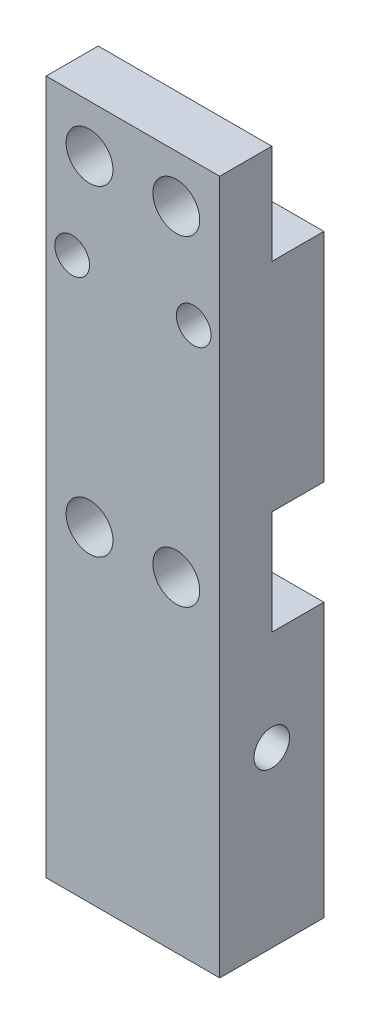
ISO-10303-21;
HEADER;
FILE_DESCRIPTION(('STEP AP214'),'2;1');
FILE_NAME('part.step','',(''),(''),'','','');
FILE_SCHEMA(('AUTOMOTIVE_DESIGN { 1 0 10303 214 1 1 1 1 }'));
ENDSEC;
DATA;
#1=APPLICATION_CONTEXT('core data for automotive mechanical design processes');
#2=APPLICATION_PROTOCOL_DEFINITION('international standard','automotive_design',2000,#1);
#3=PRODUCT_CONTEXT('',#1,'mechanical');
#4=PRODUCT('Part','Part','',(#3));
#5=PRODUCT_RELATED_PRODUCT_CATEGORY('part','',(#4));
#6=PRODUCT_DEFINITION_FORMATION('','',#4);
#7=PRODUCT_DEFINITION_CONTEXT('part definition',#1,'design');
#8=PRODUCT_DEFINITION('design','',#6,#7);
#9=PRODUCT_DEFINITION_SHAPE('','',#8);
#10=(LENGTH_UNIT() NAMED_UNIT(*) SI_UNIT(.MILLI.,.METRE.));
#11=(NAMED_UNIT(*) PLANE_ANGLE_UNIT() SI_UNIT($,.RADIAN.));
#12=(NAMED_UNIT(*) SI_UNIT($,.STERADIAN.) SOLID_ANGLE_UNIT());
#13=UNCERTAINTY_MEASURE_WITH_UNIT(LENGTH_MEASURE(1.E-05),#10,'distance_accuracy_value','');
#14=(GEOMETRIC_REPRESENTATION_CONTEXT(3) GLOBAL_UNCERTAINTY_ASSIGNED_CONTEXT((#13)) GLOBAL_UNIT_ASSIGNED_CONTEXT((#10,
#11,#12)) REPRESENTATION_CONTEXT('',''));
#15=CARTESIAN_POINT('',(0.,0.,0.));
#16=DIRECTION('',(0.,0.,1.));
#17=DIRECTION('',(1.,0.,0.));
#18=AXIS2_PLACEMENT_3D('',#15,#16,#17);
#19=CARTESIAN_POINT('',(0.,40.,0.));
#20=DIRECTION('',(0.,1.,0.));
#21=DIRECTION('',(0.,0.,1.));
#22=AXIS2_PLACEMENT_3D('',#19,#20,#21);
#23=PLANE('',#22);
#24=DIRECTION('',(0.,0.,-1.));
#25=VECTOR('',#24,1.);
#26=CARTESIAN_POINT('',(5.,40.,-3.));
#27=LINE('',#26,#25);
#28=CARTESIAN_POINT('',(5.,40.,3.));
#29=VERTEX_POINT('',#28);
#30=CARTESIAN_POINT('',(5.,40.,0.));
#31=VERTEX_POINT('',#30);
#32=EDGE_CURVE('E240',#29,#31,#27,.T.);
#33=ORIENTED_EDGE('',*,*,#32,.T.);
#34=DIRECTION('',(1.,0.,0.));
#35=VECTOR('',#34,1.);
#36=CARTESIAN_POINT('',(5.,40.,0.));
#37=LINE('',#36,#35);
#38=CARTESIAN_POINT('',(-5.,40.,0.));
#39=VERTEX_POINT('',#38);
#40=EDGE_CURVE('E141',#39,#31,#37,.T.);
#41=ORIENTED_EDGE('',*,*,#40,.F.);
#42=DIRECTION('',(0.,0.,1.));
#43=VECTOR('',#42,1.);
#44=CARTESIAN_POINT('',(-5.,40.,-3.));
#45=LINE('',#44,#43);
#46=CARTESIAN_POINT('',(-5.,40.,3.));
#47=VERTEX_POINT('',#46);
#48=EDGE_CURVE('E235',#39,#47,#45,.T.);
#49=ORIENTED_EDGE('',*,*,#48,.T.);
#50=DIRECTION('',(1.,0.,0.));
#51=VECTOR('',#50,1.);
#52=CARTESIAN_POINT('',(-5.,40.,3.));
#53=LINE('',#52,#51);
#54=EDGE_CURVE('E237',#47,#29,#53,.T.);
#55=ORIENTED_EDGE('',*,*,#54,.T.);
#56=EDGE_LOOP('',(#33,#41,#49,#55));
#57=FACE_BOUND('',#56,.T.);
#58=ADVANCED_FACE('F37',(#57),#23,.T.);
#59=CARTESIAN_POINT('',(-2.5,37.25,-3.));
#60=DIRECTION('',(0.,0.,-1.));
#61=DIRECTION('',(-1.,0.,0.));
#62=AXIS2_PLACEMENT_3D('',#59,#60,#61);
#63=CYLINDRICAL_SURFACE('',#62,1.34999999999999);
#64=CARTESIAN_POINT('',(-2.5,37.25,3.));
#65=DIRECTION('',(0.,0.,-1.));
#66=DIRECTION('',(-1.,0.,0.));
#67=AXIS2_PLACEMENT_3D('',#64,#65,#66);
#68=CIRCLE('',#67,1.35);
#69=CARTESIAN_POINT('',(-3.85,37.25,3.));
#70=VERTEX_POINT('',#69);
#71=EDGE_CURVE('E219',#70,#70,#68,.T.);
#72=ORIENTED_EDGE('',*,*,#71,.F.);
#73=EDGE_LOOP('',(#72));
#74=FACE_BOUND('',#73,.T.);
#75=CARTESIAN_POINT('',(-2.5,37.25,0.));
#76=DIRECTION('',(0.,0.,-1.));
#77=DIRECTION('',(-1.,0.,0.));
#78=AXIS2_PLACEMENT_3D('',#75,#76,#77);
#79=CIRCLE('',#78,1.34999999999999);
#80=CARTESIAN_POINT('',(-3.84999999999999,37.25,0.));
#81=VERTEX_POINT('',#80);
#82=EDGE_CURVE('E156',#81,#81,#79,.F.);
#83=ORIENTED_EDGE('',*,*,#82,.F.);
#84=EDGE_LOOP('',(#83));
#85=FACE_BOUND('',#84,.T.);
#86=ADVANCED_FACE('F281',(#74,#85),#63,.F.);
#87=CARTESIAN_POINT('',(2.5,37.25,-3.));
#88=DIRECTION('',(0.,0.,-1.));
#89=DIRECTION('',(-1.,0.,0.));
#90=AXIS2_PLACEMENT_3D('',#87,#88,#89);
#91=CYLINDRICAL_SURFACE('',#90,1.34999999999999);
#92=CARTESIAN_POINT('',(2.5,37.25,3.));
#93=DIRECTION('',(0.,0.,-1.));
#94=DIRECTION('',(-1.,0.,0.));
#95=AXIS2_PLACEMENT_3D('',#92,#93,#94);
#96=CIRCLE('',#95,1.35);
#97=CARTESIAN_POINT('',(1.15,37.25,3.));
#98=VERTEX_POINT('',#97);
#99=EDGE_CURVE('E216',#98,#98,#96,.T.);
#100=ORIENTED_EDGE('',*,*,#99,.F.);
#101=EDGE_LOOP('',(#100));
#102=FACE_BOUND('',#101,.T.);
#103=CARTESIAN_POINT('',(2.5,37.25,0.));
#104=DIRECTION('',(0.,0.,-1.));
#105=DIRECTION('',(-1.,0.,0.));
#106=AXIS2_PLACEMENT_3D('',#103,#104,#105);
#107=CIRCLE('',#106,1.34999999999999);
#108=CARTESIAN_POINT('',(1.15000000000001,37.25,0.));
#109=VERTEX_POINT('',#108);
#110=EDGE_CURVE('E41',#109,#109,#107,.F.);
#111=ORIENTED_EDGE('',*,*,#110,.F.);
#112=EDGE_LOOP('',(#111));
#113=FACE_BOUND('',#112,.T.);
#114=ADVANCED_FACE('F287',(#102,#113),#91,.F.);
#115=CARTESIAN_POINT('',(-5.,40.,-3.));
#116=DIRECTION('',(0.,0.,1.));
#117=DIRECTION('',(1.,0.,0.));
#118=AXIS2_PLACEMENT_3D('',#115,#116,#117);
#119=PLANE('',#118);
#120=CARTESIAN_POINT('',(3.5,31.81,-3.));
#121=DIRECTION('',(0.,0.,-1.));
#122=DIRECTION('',(-1.,0.,0.));
#123=AXIS2_PLACEMENT_3D('',#120,#121,#122);
#124=CIRCLE('',#123,1.);
#125=CARTESIAN_POINT('',(2.5,31.81,-3.));
#126=VERTEX_POINT('',#125);
#127=EDGE_CURVE('E204',#126,#126,#124,.T.);
#128=ORIENTED_EDGE('',*,*,#127,.F.);
#129=EDGE_LOOP('',(#128));
#130=FACE_BOUND('',#129,.T.);
#131=CARTESIAN_POINT('',(-3.5,31.81,-3.));
#132=DIRECTION('',(0.,0.,-1.));
#133=DIRECTION('',(-1.,0.,0.));
#134=AXIS2_PLACEMENT_3D('',#131,#132,#133);
#135=CIRCLE('',#134,1.);
#136=CARTESIAN_POINT('',(-4.5,31.81,-3.));
#137=VERTEX_POINT('',#136);
#138=EDGE_CURVE('E210',#137,#137,#135,.T.);
#139=ORIENTED_EDGE('',*,*,#138,.F.);
#140=EDGE_LOOP('',(#139));
#141=FACE_BOUND('',#140,.T.);
#142=DIRECTION('',(0.,-1.,0.));
#143=VECTOR('',#142,1.);
#144=CARTESIAN_POINT('',(-5.,40.,-3.));
#145=LINE('',#144,#143);
#146=CARTESIAN_POINT('',(-5.,34.25,-3.));
#147=VERTEX_POINT('',#146);
#148=CARTESIAN_POINT('',(-5.,21.75,-3.));
#149=VERTEX_POINT('',#148);
#150=EDGE_CURVE('E252',#147,#149,#145,.T.);
#151=ORIENTED_EDGE('',*,*,#150,.F.);
#152=DIRECTION('',(-1.,0.,0.));
#153=VECTOR('',#152,1.);
#154=CARTESIAN_POINT('',(5.,34.25,-3.));
#155=LINE('',#154,#153);
#156=CARTESIAN_POINT('',(5.,34.25,-3.));
#157=VERTEX_POINT('',#156);
#158=EDGE_CURVE('E145',#157,#147,#155,.T.);
#159=ORIENTED_EDGE('',*,*,#158,.F.);
#160=DIRECTION('',(0.,-1.,0.));
#161=VECTOR('',#160,1.);
#162=CARTESIAN_POINT('',(5.,40.,-3.));
#163=LINE('',#162,#161);
#164=CARTESIAN_POINT('',(5.,21.75,-3.));
#165=VERTEX_POINT('',#164);
#166=EDGE_CURVE('E150',#157,#165,#163,.T.);
#167=ORIENTED_EDGE('',*,*,#166,.T.);
#168=DIRECTION('',(1.,0.,0.));
#169=VECTOR('',#168,1.);
#170=CARTESIAN_POINT('',(5.,21.75,-3.));
#171=LINE('',#170,#169);
#172=EDGE_CURVE('E163',#149,#165,#171,.T.);
#173=ORIENTED_EDGE('',*,*,#172,.F.);
#174=EDGE_LOOP('',(#151,#159,#167,#173));
#175=FACE_BOUND('',#174,.T.);
#176=ADVANCED_FACE('F275',(#130,#141,#175),#119,.F.);
#177=CARTESIAN_POINT('',(-2.5,18.75,-3.));
#178=DIRECTION('',(0.,0.,-1.));
#179=DIRECTION('',(-1.,0.,0.));
#180=AXIS2_PLACEMENT_3D('',#177,#178,#179);
#181=CYLINDRICAL_SURFACE('',#180,1.34999999999999);
#182=CARTESIAN_POINT('',(-2.5,18.75,3.));
#183=DIRECTION('',(0.,0.,-1.));
#184=DIRECTION('',(-1.,0.,0.));
#185=AXIS2_PLACEMENT_3D('',#182,#183,#184);
#186=CIRCLE('',#185,1.35);
#187=CARTESIAN_POINT('',(-3.85,18.75,3.));
#188=VERTEX_POINT('',#187);
#189=EDGE_CURVE('E225',#188,#188,#186,.T.);
#190=ORIENTED_EDGE('',*,*,#189,.F.);
#191=EDGE_LOOP('',(#190));
#192=FACE_BOUND('',#191,.T.);
#193=CARTESIAN_POINT('',(-2.5,18.75,0.));
#194=DIRECTION('',(0.,0.,-1.));
#195=DIRECTION('',(-1.,0.,0.));
#196=AXIS2_PLACEMENT_3D('',#193,#194,#195);
#197=CIRCLE('',#196,1.34999999999999);
#198=CARTESIAN_POINT('',(-3.84999999999999,18.75,0.));
#199=VERTEX_POINT('',#198);
#200=EDGE_CURVE('E183',#199,#199,#197,.F.);
#201=ORIENTED_EDGE('',*,*,#200,.F.);
#202=EDGE_LOOP('',(#201));
#203=FACE_BOUND('',#202,.T.);
#204=ADVANCED_FACE('F266',(#192,#203),#181,.F.);
#205=CARTESIAN_POINT('',(2.5,18.75,-3.));
#206=DIRECTION('',(0.,0.,-1.));
#207=DIRECTION('',(-1.,0.,0.));
#208=AXIS2_PLACEMENT_3D('',#205,#206,#207);
#209=CYLINDRICAL_SURFACE('',#208,1.34999999999999);
#210=CARTESIAN_POINT('',(2.5,18.75,3.));
#211=DIRECTION('',(0.,0.,-1.));
#212=DIRECTION('',(-1.,0.,0.));
#213=AXIS2_PLACEMENT_3D('',#210,#211,#212);
#214=CIRCLE('',#213,1.35);
#215=CARTESIAN_POINT('',(1.15,18.75,3.));
#216=VERTEX_POINT('',#215);
#217=EDGE_CURVE('E222',#216,#216,#214,.T.);
#218=ORIENTED_EDGE('',*,*,#217,.F.);
#219=EDGE_LOOP('',(#218));
#220=FACE_BOUND('',#219,.T.);
#221=CARTESIAN_POINT('',(2.5,18.75,0.));
#222=DIRECTION('',(0.,0.,-1.));
#223=DIRECTION('',(-1.,0.,0.));
#224=AXIS2_PLACEMENT_3D('',#221,#222,#223);
#225=CIRCLE('',#224,1.34999999999999);
#226=CARTESIAN_POINT('',(1.15000000000001,18.75,0.));
#227=VERTEX_POINT('',#226);
#228=EDGE_CURVE('E175',#227,#227,#225,.F.);
#229=ORIENTED_EDGE('',*,*,#228,.F.);
#230=EDGE_LOOP('',(#229));
#231=FACE_BOUND('',#230,.T.);
#232=ADVANCED_FACE('F263',(#220,#231),#209,.F.);
#233=CARTESIAN_POINT('',(-5.,15.75,-3.));
#234=VERTEX_POINT('',#233);
#235=CARTESIAN_POINT('',(-5.,0.,-3.));
#236=VERTEX_POINT('',#235);
#237=EDGE_CURVE('E242',#234,#236,#145,.T.);
#238=ORIENTED_EDGE('',*,*,#237,.F.);
#239=DIRECTION('',(-1.,0.,0.));
#240=VECTOR('',#239,1.);
#241=CARTESIAN_POINT('',(5.,15.75,-3.));
#242=LINE('',#241,#240);
#243=CARTESIAN_POINT('',(5.,15.75,-3.));
#244=VERTEX_POINT('',#243);
#245=EDGE_CURVE('E159',#244,#234,#242,.T.);
#246=ORIENTED_EDGE('',*,*,#245,.F.);
#247=CARTESIAN_POINT('',(5.,0.,-3.));
#248=VERTEX_POINT('',#247);
#249=EDGE_CURVE('E254',#244,#248,#163,.T.);
#250=ORIENTED_EDGE('',*,*,#249,.T.);
#251=DIRECTION('',(-1.,0.,0.));
#252=VECTOR('',#251,1.);
#253=CARTESIAN_POINT('',(-5.,0.,-3.));
#254=LINE('',#253,#252);
#255=EDGE_CURVE('E238',#248,#236,#254,.T.);
#256=ORIENTED_EDGE('',*,*,#255,.T.);
#257=EDGE_LOOP('',(#238,#246,#250,#256));
#258=FACE_BOUND('',#257,.T.);
#259=ADVANCED_FACE('F265',(#258),#119,.F.);
#260=CARTESIAN_POINT('',(-5.,40.,-3.));
#261=DIRECTION('',(1.,0.,0.));
#262=DIRECTION('',(0.,0.,-1.));
#263=AXIS2_PLACEMENT_3D('',#260,#261,#262);
#264=PLANE('',#263);
#265=DIRECTION('',(0.,1.,0.));
#266=VECTOR('',#265,1.);
#267=CARTESIAN_POINT('',(-5.,40.,0.));
#268=LINE('',#267,#266);
#269=CARTESIAN_POINT('',(-5.,34.25,0.));
#270=VERTEX_POINT('',#269);
#271=EDGE_CURVE('E54',#270,#39,#268,.T.);
#272=ORIENTED_EDGE('',*,*,#271,.F.);
#273=DIRECTION('',(0.,0.,-1.));
#274=VECTOR('',#273,1.);
#275=CARTESIAN_POINT('',(-5.,34.25,0.));
#276=LINE('',#275,#274);
#277=EDGE_CURVE('E135',#270,#147,#276,.T.);
#278=ORIENTED_EDGE('',*,*,#277,.T.);
#279=ORIENTED_EDGE('',*,*,#150,.T.);
#280=DIRECTION('',(0.,0.,-1.));
#281=VECTOR('',#280,1.);
#282=CARTESIAN_POINT('',(-5.,21.75,0.));
#283=LINE('',#282,#281);
#284=CARTESIAN_POINT('',(-5.,21.75,0.));
#285=VERTEX_POINT('',#284);
#286=EDGE_CURVE('E176',#285,#149,#283,.T.);
#287=ORIENTED_EDGE('',*,*,#286,.F.);
#288=DIRECTION('',(0.,1.,0.));
#289=VECTOR('',#288,1.);
#290=CARTESIAN_POINT('',(-5.,21.75,0.));
#291=LINE('',#290,#289);
#292=CARTESIAN_POINT('',(-5.,15.75,0.));
#293=VERTEX_POINT('',#292);
#294=EDGE_CURVE('E166',#293,#285,#291,.T.);
#295=ORIENTED_EDGE('',*,*,#294,.F.);
#296=DIRECTION('',(0.,0.,-1.));
#297=VECTOR('',#296,1.);
#298=CARTESIAN_POINT('',(-5.,15.75,0.));
#299=LINE('',#298,#297);
#300=EDGE_CURVE('E179',#293,#234,#299,.T.);
#301=ORIENTED_EDGE('',*,*,#300,.T.);
#302=ORIENTED_EDGE('',*,*,#237,.T.);
#303=DIRECTION('',(0.,0.,1.));
#304=VECTOR('',#303,1.);
#305=CARTESIAN_POINT('',(-5.,0.,-3.));
#306=LINE('',#305,#304);
#307=CARTESIAN_POINT('',(-5.,0.,3.));
#308=VERTEX_POINT('',#307);
#309=EDGE_CURVE('E234',#236,#308,#306,.T.);
#310=ORIENTED_EDGE('',*,*,#309,.T.);
#311=DIRECTION('',(0.,-1.,0.));
#312=VECTOR('',#311,1.);
#313=CARTESIAN_POINT('',(-5.,40.,3.));
#314=LINE('',#313,#312);
#315=EDGE_CURVE('E11',#47,#308,#314,.T.);
#316=ORIENTED_EDGE('',*,*,#315,.F.);
#317=ORIENTED_EDGE('',*,*,#48,.F.);
#318=EDGE_LOOP('',(#272,#278,#279,#287,#295,#301,#302,#310,#316,#317));
#319=FACE_BOUND('',#318,.T.);
#320=CARTESIAN_POINT('',(-5.,10.,0.));
#321=DIRECTION('',(1.,0.,0.));
#322=DIRECTION('',(0.,0.,-1.));
#323=AXIS2_PLACEMENT_3D('',#320,#321,#322);
#324=CIRCLE('',#323,1.025);
#325=CARTESIAN_POINT('',(-5.,10.,-1.025));
#326=VERTEX_POINT('',#325);
#327=EDGE_CURVE('E189',#326,#326,#324,.T.);
#328=ORIENTED_EDGE('',*,*,#327,.T.);
#329=EDGE_LOOP('',(#328));
#330=FACE_BOUND('',#329,.T.);
#331=ADVANCED_FACE('F39',(#319,#330),#264,.F.);
#332=CARTESIAN_POINT('',(-5.,40.,3.));
#333=DIRECTION('',(0.,0.,-1.));
#334=DIRECTION('',(-1.,0.,0.));
#335=AXIS2_PLACEMENT_3D('',#332,#333,#334);
#336=PLANE('',#335);
#337=CARTESIAN_POINT('',(3.5,31.81,3.));
#338=DIRECTION('',(0.,0.,-1.));
#339=DIRECTION('',(-1.,0.,0.));
#340=AXIS2_PLACEMENT_3D('',#337,#338,#339);
#341=CIRCLE('',#340,0.999999999999998);
#342=CARTESIAN_POINT('',(2.5,31.81,3.));
#343=VERTEX_POINT('',#342);
#344=EDGE_CURVE('E207',#343,#343,#341,.T.);
#345=ORIENTED_EDGE('',*,*,#344,.T.);
#346=EDGE_LOOP('',(#345));
#347=FACE_BOUND('',#346,.T.);
#348=CARTESIAN_POINT('',(-3.5,31.81,3.));
#349=DIRECTION('',(0.,0.,-1.));
#350=DIRECTION('',(-1.,0.,0.));
#351=AXIS2_PLACEMENT_3D('',#348,#349,#350);
#352=CIRCLE('',#351,0.999999999999999);
#353=CARTESIAN_POINT('',(-4.5,31.81,3.));
#354=VERTEX_POINT('',#353);
#355=EDGE_CURVE('E213',#354,#354,#352,.T.);
#356=ORIENTED_EDGE('',*,*,#355,.T.);
#357=EDGE_LOOP('',(#356));
#358=FACE_BOUND('',#357,.T.);
#359=ORIENTED_EDGE('',*,*,#99,.T.);
#360=EDGE_LOOP('',(#359));
#361=FACE_BOUND('',#360,.T.);
#362=ORIENTED_EDGE('',*,*,#71,.T.);
#363=EDGE_LOOP('',(#362));
#364=FACE_BOUND('',#363,.T.);
#365=ORIENTED_EDGE('',*,*,#217,.T.);
#366=EDGE_LOOP('',(#365));
#367=FACE_BOUND('',#366,.T.);
#368=ORIENTED_EDGE('',*,*,#189,.T.);
#369=EDGE_LOOP('',(#368));
#370=FACE_BOUND('',#369,.T.);
#371=DIRECTION('',(1.,0.,0.));
#372=VECTOR('',#371,1.);
#373=CARTESIAN_POINT('',(-5.,0.,3.));
#374=LINE('',#373,#372);
#375=CARTESIAN_POINT('',(5.,0.,3.));
#376=VERTEX_POINT('',#375);
#377=EDGE_CURVE('E245',#308,#376,#374,.T.);
#378=ORIENTED_EDGE('',*,*,#377,.T.);
#379=DIRECTION('',(0.,-1.,0.));
#380=VECTOR('',#379,1.);
#381=CARTESIAN_POINT('',(5.,40.,3.));
#382=LINE('',#381,#380);
#383=EDGE_CURVE('E46',#29,#376,#382,.T.);
#384=ORIENTED_EDGE('',*,*,#383,.F.);
#385=ORIENTED_EDGE('',*,*,#54,.F.);
#386=ORIENTED_EDGE('',*,*,#315,.T.);
#387=EDGE_LOOP('',(#378,#384,#385,#386));
#388=FACE_BOUND('',#387,.T.);
#389=ADVANCED_FACE('F298',(#347,#358,#361,#364,#367,#370,#388),#336,.F.);
#390=CARTESIAN_POINT('',(5.,40.,-3.));
#391=DIRECTION('',(-1.,0.,0.));
#392=DIRECTION('',(0.,0.,1.));
#393=AXIS2_PLACEMENT_3D('',#390,#391,#392);
#394=PLANE('',#393);
#395=CARTESIAN_POINT('',(5.,10.,0.));
#396=DIRECTION('',(1.,0.,0.));
#397=DIRECTION('',(0.,0.,-1.));
#398=AXIS2_PLACEMENT_3D('',#395,#396,#397);
#399=CIRCLE('',#398,1.025);
#400=CARTESIAN_POINT('',(5.,10.,-1.025));
#401=VERTEX_POINT('',#400);
#402=EDGE_CURVE('E186',#401,#401,#399,.T.);
#403=ORIENTED_EDGE('',*,*,#402,.F.);
#404=EDGE_LOOP('',(#403));
#405=FACE_BOUND('',#404,.T.);
#406=ORIENTED_EDGE('',*,*,#166,.F.);
#407=DIRECTION('',(0.,0.,-1.));
#408=VECTOR('',#407,1.);
#409=CARTESIAN_POINT('',(5.,34.25,0.));
#410=LINE('',#409,#408);
#411=CARTESIAN_POINT('',(5.,34.25,0.));
#412=VERTEX_POINT('',#411);
#413=EDGE_CURVE('E132',#412,#157,#410,.T.);
#414=ORIENTED_EDGE('',*,*,#413,.F.);
#415=DIRECTION('',(0.,-1.,0.));
#416=VECTOR('',#415,1.);
#417=CARTESIAN_POINT('',(5.,40.,0.));
#418=LINE('',#417,#416);
#419=EDGE_CURVE('E136',#31,#412,#418,.T.);
#420=ORIENTED_EDGE('',*,*,#419,.F.);
#421=ORIENTED_EDGE('',*,*,#32,.F.);
#422=ORIENTED_EDGE('',*,*,#383,.T.);
#423=DIRECTION('',(0.,0.,-1.));
#424=VECTOR('',#423,1.);
#425=CARTESIAN_POINT('',(5.,0.,-3.));
#426=LINE('',#425,#424);
#427=EDGE_CURVE('E247',#376,#248,#426,.T.);
#428=ORIENTED_EDGE('',*,*,#427,.T.);
#429=ORIENTED_EDGE('',*,*,#249,.F.);
#430=DIRECTION('',(0.,0.,-1.));
#431=VECTOR('',#430,1.);
#432=CARTESIAN_POINT('',(5.,15.75,0.));
#433=LINE('',#432,#431);
#434=CARTESIAN_POINT('',(5.,15.75,0.));
#435=VERTEX_POINT('',#434);
#436=EDGE_CURVE('E169',#435,#244,#433,.T.);
#437=ORIENTED_EDGE('',*,*,#436,.F.);
#438=DIRECTION('',(0.,-1.,0.));
#439=VECTOR('',#438,1.);
#440=CARTESIAN_POINT('',(5.,21.75,0.));
#441=LINE('',#440,#439);
#442=CARTESIAN_POINT('',(5.,21.75,0.));
#443=VERTEX_POINT('',#442);
#444=EDGE_CURVE('E160',#443,#435,#441,.T.);
#445=ORIENTED_EDGE('',*,*,#444,.F.);
#446=DIRECTION('',(0.,0.,-1.));
#447=VECTOR('',#446,1.);
#448=CARTESIAN_POINT('',(5.,21.75,0.));
#449=LINE('',#448,#447);
#450=EDGE_CURVE('E173',#443,#165,#449,.T.);
#451=ORIENTED_EDGE('',*,*,#450,.T.);
#452=EDGE_LOOP('',(#406,#414,#420,#421,#422,#428,#429,#437,#445,#451));
#453=FACE_BOUND('',#452,.T.);
#454=ADVANCED_FACE('F148',(#405,#453),#394,.F.);
#455=CARTESIAN_POINT('',(0.,0.,0.));
#456=DIRECTION('',(0.,1.,0.));
#457=DIRECTION('',(0.,0.,1.));
#458=AXIS2_PLACEMENT_3D('',#455,#456,#457);
#459=PLANE('',#458);
#460=CARTESIAN_POINT('',(-2.5,0.,0.));
#461=DIRECTION('',(0.,-1.,0.));
#462=DIRECTION('',(0.,0.,-1.));
#463=AXIS2_PLACEMENT_3D('',#460,#461,#462);
#464=CIRCLE('',#463,1.02499999999999);
#465=CARTESIAN_POINT('',(-2.5,0.,-1.02499999999999));
#466=VERTEX_POINT('',#465);
#467=EDGE_CURVE('E228',#466,#466,#464,.T.);
#468=ORIENTED_EDGE('',*,*,#467,.F.);
#469=EDGE_LOOP('',(#468));
#470=FACE_BOUND('',#469,.T.);
#471=CARTESIAN_POINT('',(2.5,0.,0.));
#472=DIRECTION('',(0.,-1.,0.));
#473=DIRECTION('',(0.,0.,-1.));
#474=AXIS2_PLACEMENT_3D('',#471,#472,#473);
#475=CIRCLE('',#474,1.02499999999999);
#476=CARTESIAN_POINT('',(2.5,0.,-1.02499999999999));
#477=VERTEX_POINT('',#476);
#478=EDGE_CURVE('E231',#477,#477,#475,.T.);
#479=ORIENTED_EDGE('',*,*,#478,.F.);
#480=EDGE_LOOP('',(#479));
#481=FACE_BOUND('',#480,.T.);
#482=ORIENTED_EDGE('',*,*,#309,.F.);
#483=ORIENTED_EDGE('',*,*,#255,.F.);
#484=ORIENTED_EDGE('',*,*,#427,.F.);
#485=ORIENTED_EDGE('',*,*,#377,.F.);
#486=EDGE_LOOP('',(#482,#483,#484,#485));
#487=FACE_BOUND('',#486,.T.);
#488=ADVANCED_FACE('F293',(#470,#481,#487),#459,.F.);
#489=CARTESIAN_POINT('',(2.5,0.,0.));
#490=DIRECTION('',(0.,-1.,0.));
#491=DIRECTION('',(0.,0.,-1.));
#492=AXIS2_PLACEMENT_3D('',#489,#490,#491);
#493=CYLINDRICAL_SURFACE('',#492,1.02499999999999);
#494=CARTESIAN_POINT('',(2.5,10.,0.));
#495=DIRECTION('',(-0.707106781186547,-0.707106781186547,0.));
#496=DIRECTION('',(0.707106781186547,-0.707106781186547,0.));
#497=AXIS2_PLACEMENT_3D('',#494,#495,#496);
#498=ELLIPSE('',#497,1.44956890143242,1.025);
#499=CARTESIAN_POINT('',(2.5,10.,1.025));
#500=VERTEX_POINT('',#499);
#501=CARTESIAN_POINT('',(2.5,10.,-1.025));
#502=VERTEX_POINT('',#501);
#503=EDGE_CURVE('E198',#500,#502,#498,.F.);
#504=ORIENTED_EDGE('',*,*,#503,.T.);
#505=CARTESIAN_POINT('',(2.5,10.,0.));
#506=DIRECTION('',(0.707106781186547,-0.707106781186547,0.));
#507=DIRECTION('',(-0.707106781186547,-0.707106781186547,0.));
#508=AXIS2_PLACEMENT_3D('',#505,#506,#507);
#509=ELLIPSE('',#508,1.44956890143242,1.025);
#510=EDGE_CURVE('E201',#502,#500,#509,.F.);
#511=ORIENTED_EDGE('',*,*,#510,.T.);
#512=EDGE_LOOP('',(#504,#511));
#513=FACE_BOUND('',#512,.T.);
#514=ORIENTED_EDGE('',*,*,#478,.T.);
#515=EDGE_LOOP('',(#514));
#516=FACE_BOUND('',#515,.T.);
#517=ADVANCED_FACE('F291',(#513,#516),#493,.F.);
#518=CARTESIAN_POINT('',(-2.5,0.,0.));
#519=DIRECTION('',(0.,-1.,0.));
#520=DIRECTION('',(0.,0.,-1.));
#521=AXIS2_PLACEMENT_3D('',#518,#519,#520);
#522=CYLINDRICAL_SURFACE('',#521,1.02499999999999);
#523=CARTESIAN_POINT('',(-2.5,10.,0.));
#524=DIRECTION('',(-0.707106781186547,-0.707106781186547,0.));
#525=DIRECTION('',(0.707106781186547,-0.707106781186547,0.));
#526=AXIS2_PLACEMENT_3D('',#523,#524,#525);
#527=ELLIPSE('',#526,1.44956890143242,1.025);
#528=CARTESIAN_POINT('',(-2.5,10.,1.025));
#529=VERTEX_POINT('',#528);
#530=CARTESIAN_POINT('',(-2.5,10.,-1.025));
#531=VERTEX_POINT('',#530);
#532=EDGE_CURVE('E192',#529,#531,#527,.F.);
#533=ORIENTED_EDGE('',*,*,#532,.T.);
#534=CARTESIAN_POINT('',(-2.5,10.,0.));
#535=DIRECTION('',(0.707106781186547,-0.707106781186547,0.));
#536=DIRECTION('',(-0.707106781186547,-0.707106781186547,0.));
#537=AXIS2_PLACEMENT_3D('',#534,#535,#536);
#538=ELLIPSE('',#537,1.44956890143242,1.025);
#539=EDGE_CURVE('E195',#531,#529,#538,.F.);
#540=ORIENTED_EDGE('',*,*,#539,.T.);
#541=EDGE_LOOP('',(#533,#540));
#542=FACE_BOUND('',#541,.T.);
#543=ORIENTED_EDGE('',*,*,#467,.T.);
#544=EDGE_LOOP('',(#543));
#545=FACE_BOUND('',#544,.T.);
#546=ADVANCED_FACE('F356',(#542,#545),#522,.F.);
#547=CARTESIAN_POINT('',(-3.5,31.81,-3.));
#548=DIRECTION('',(0.,0.,-1.));
#549=DIRECTION('',(-1.,0.,0.));
#550=AXIS2_PLACEMENT_3D('',#547,#548,#549);
#551=CYLINDRICAL_SURFACE('',#550,0.999999999999999);
#552=ORIENTED_EDGE('',*,*,#355,.F.);
#553=EDGE_LOOP('',(#552));
#554=FACE_BOUND('',#553,.T.);
#555=ORIENTED_EDGE('',*,*,#138,.T.);
#556=EDGE_LOOP('',(#555));
#557=FACE_BOUND('',#556,.T.);
#558=ADVANCED_FACE('F352',(#554,#557),#551,.F.);
#559=CARTESIAN_POINT('',(3.5,31.81,-3.));
#560=DIRECTION('',(0.,0.,-1.));
#561=DIRECTION('',(-1.,0.,0.));
#562=AXIS2_PLACEMENT_3D('',#559,#560,#561);
#563=CYLINDRICAL_SURFACE('',#562,0.999999999999999);
#564=ORIENTED_EDGE('',*,*,#344,.F.);
#565=EDGE_LOOP('',(#564));
#566=FACE_BOUND('',#565,.T.);
#567=ORIENTED_EDGE('',*,*,#127,.T.);
#568=EDGE_LOOP('',(#567));
#569=FACE_BOUND('',#568,.T.);
#570=ADVANCED_FACE('F342',(#566,#569),#563,.F.);
#571=CARTESIAN_POINT('',(5.,10.,0.));
#572=DIRECTION('',(1.,0.,0.));
#573=DIRECTION('',(0.,0.,-1.));
#574=AXIS2_PLACEMENT_3D('',#571,#572,#573);
#575=CYLINDRICAL_SURFACE('',#574,1.025);
#576=ORIENTED_EDGE('',*,*,#327,.F.);
#577=EDGE_LOOP('',(#576));
#578=FACE_BOUND('',#577,.T.);
#579=ORIENTED_EDGE('',*,*,#402,.T.);
#580=EDGE_LOOP('',(#579));
#581=FACE_BOUND('',#580,.T.);
#582=ORIENTED_EDGE('',*,*,#532,.F.);
#583=ORIENTED_EDGE('',*,*,#539,.F.);
#584=EDGE_LOOP('',(#582,#583));
#585=FACE_BOUND('',#584,.T.);
#586=ORIENTED_EDGE('',*,*,#503,.F.);
#587=ORIENTED_EDGE('',*,*,#510,.F.);
#588=EDGE_LOOP('',(#586,#587));
#589=FACE_BOUND('',#588,.T.);
#590=ADVANCED_FACE('F334',(#578,#581,#585,#589),#575,.F.);
#591=CARTESIAN_POINT('',(0.,0.,0.));
#592=DIRECTION('',(0.,0.,-1.));
#593=DIRECTION('',(-1.,0.,0.));
#594=AXIS2_PLACEMENT_3D('',#591,#592,#593);
#595=PLANE('',#594);
#596=ORIENTED_EDGE('',*,*,#444,.T.);
#597=DIRECTION('',(-1.,0.,0.));
#598=VECTOR('',#597,1.);
#599=CARTESIAN_POINT('',(5.,15.75,0.));
#600=LINE('',#599,#598);
#601=EDGE_CURVE('E162',#435,#293,#600,.T.);
#602=ORIENTED_EDGE('',*,*,#601,.T.);
#603=ORIENTED_EDGE('',*,*,#294,.T.);
#604=DIRECTION('',(1.,0.,0.));
#605=VECTOR('',#604,1.);
#606=CARTESIAN_POINT('',(5.,21.75,0.));
#607=LINE('',#606,#605);
#608=EDGE_CURVE('E62',#285,#443,#607,.T.);
#609=ORIENTED_EDGE('',*,*,#608,.T.);
#610=EDGE_LOOP('',(#596,#602,#603,#609));
#611=FACE_BOUND('',#610,.T.);
#612=ORIENTED_EDGE('',*,*,#228,.T.);
#613=EDGE_LOOP('',(#612));
#614=FACE_BOUND('',#613,.T.);
#615=ORIENTED_EDGE('',*,*,#200,.T.);
#616=EDGE_LOOP('',(#615));
#617=FACE_BOUND('',#616,.T.);
#618=ADVANCED_FACE('F260',(#611,#614,#617),#595,.T.);
#619=CARTESIAN_POINT('',(5.,21.75,0.));
#620=DIRECTION('',(0.,1.,0.));
#621=DIRECTION('',(0.,0.,1.));
#622=AXIS2_PLACEMENT_3D('',#619,#620,#621);
#623=PLANE('',#622);
#624=ORIENTED_EDGE('',*,*,#172,.T.);
#625=ORIENTED_EDGE('',*,*,#450,.F.);
#626=ORIENTED_EDGE('',*,*,#608,.F.);
#627=ORIENTED_EDGE('',*,*,#286,.T.);
#628=EDGE_LOOP('',(#624,#625,#626,#627));
#629=FACE_BOUND('',#628,.T.);
#630=ADVANCED_FACE('F333',(#629),#623,.F.);
#631=CARTESIAN_POINT('',(5.,15.75,0.));
#632=DIRECTION('',(0.,-1.,0.));
#633=DIRECTION('',(0.,0.,-1.));
#634=AXIS2_PLACEMENT_3D('',#631,#632,#633);
#635=PLANE('',#634);
#636=ORIENTED_EDGE('',*,*,#245,.T.);
#637=ORIENTED_EDGE('',*,*,#300,.F.);
#638=ORIENTED_EDGE('',*,*,#601,.F.);
#639=ORIENTED_EDGE('',*,*,#436,.T.);
#640=EDGE_LOOP('',(#636,#637,#638,#639));
#641=FACE_BOUND('',#640,.T.);
#642=ADVANCED_FACE('F330',(#641),#635,.F.);
#643=CARTESIAN_POINT('',(0.,0.,0.));
#644=DIRECTION('',(0.,0.,-1.));
#645=DIRECTION('',(-1.,0.,0.));
#646=AXIS2_PLACEMENT_3D('',#643,#644,#645);
#647=PLANE('',#646);
#648=ORIENTED_EDGE('',*,*,#419,.T.);
#649=DIRECTION('',(-1.,0.,0.));
#650=VECTOR('',#649,1.);
#651=CARTESIAN_POINT('',(5.,34.25,0.));
#652=LINE('',#651,#650);
#653=EDGE_CURVE('E128',#412,#270,#652,.T.);
#654=ORIENTED_EDGE('',*,*,#653,.T.);
#655=ORIENTED_EDGE('',*,*,#271,.T.);
#656=ORIENTED_EDGE('',*,*,#40,.T.);
#657=EDGE_LOOP('',(#648,#654,#655,#656));
#658=FACE_BOUND('',#657,.T.);
#659=ORIENTED_EDGE('',*,*,#110,.T.);
#660=EDGE_LOOP('',(#659));
#661=FACE_BOUND('',#660,.T.);
#662=ORIENTED_EDGE('',*,*,#82,.T.);
#663=EDGE_LOOP('',(#662));
#664=FACE_BOUND('',#663,.T.);
#665=ADVANCED_FACE('F139',(#658,#661,#664),#647,.T.);
#666=CARTESIAN_POINT('',(5.,34.25,0.));
#667=DIRECTION('',(0.,-1.,0.));
#668=DIRECTION('',(0.,0.,-1.));
#669=AXIS2_PLACEMENT_3D('',#666,#667,#668);
#670=PLANE('',#669);
#671=ORIENTED_EDGE('',*,*,#158,.T.);
#672=ORIENTED_EDGE('',*,*,#277,.F.);
#673=ORIENTED_EDGE('',*,*,#653,.F.);
#674=ORIENTED_EDGE('',*,*,#413,.T.);
#675=EDGE_LOOP('',(#671,#672,#673,#674));
#676=FACE_BOUND('',#675,.T.);
#677=ADVANCED_FACE('F130',(#676),#670,.F.);
#678=CLOSED_SHELL('',(#58,#86,#114,#176,#204,#232,#259,#331,#389,#454,#488,#517,#546,#558,#570,
#590,#618,#630,#642,#665,#677));
#679=MANIFOLD_SOLID_BREP('B2',#678);
#680=ADVANCED_BREP_SHAPE_REPRESENTATION('',(#18,#679),#14);
#681=SHAPE_DEFINITION_REPRESENTATION(#9,#680);
ENDSEC;
END-ISO-10303-21;
